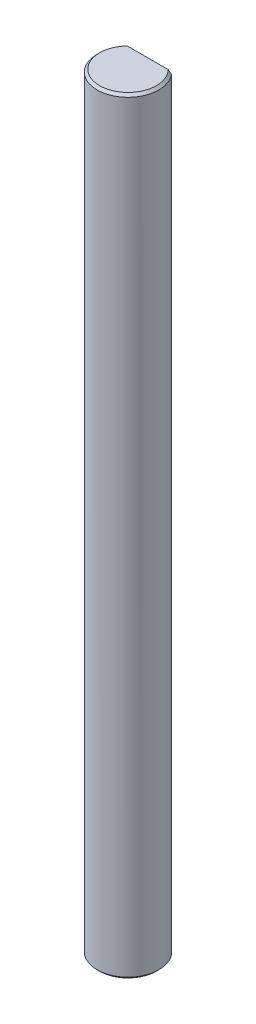
ISO-10303-21;
HEADER;
FILE_DESCRIPTION(('STEP AP214'),'2;1');
FILE_NAME('part.step','',(''),(''),'','','');
FILE_SCHEMA(('AUTOMOTIVE_DESIGN { 1 0 10303 214 1 1 1 1 }'));
ENDSEC;
DATA;
#1=APPLICATION_CONTEXT('core data for automotive mechanical design processes');
#2=APPLICATION_PROTOCOL_DEFINITION('international standard','automotive_design',2000,#1);
#3=PRODUCT_CONTEXT('',#1,'mechanical');
#4=PRODUCT('Part','Part','',(#3));
#5=PRODUCT_RELATED_PRODUCT_CATEGORY('part','',(#4));
#6=PRODUCT_DEFINITION_FORMATION('','',#4);
#7=PRODUCT_DEFINITION_CONTEXT('part definition',#1,'design');
#8=PRODUCT_DEFINITION('design','',#6,#7);
#9=PRODUCT_DEFINITION_SHAPE('','',#8);
#10=(LENGTH_UNIT() NAMED_UNIT(*) SI_UNIT(.MILLI.,.METRE.));
#11=(NAMED_UNIT(*) PLANE_ANGLE_UNIT() SI_UNIT($,.RADIAN.));
#12=(NAMED_UNIT(*) SI_UNIT($,.STERADIAN.) SOLID_ANGLE_UNIT());
#13=UNCERTAINTY_MEASURE_WITH_UNIT(LENGTH_MEASURE(1.E-05),#10,'distance_accuracy_value','');
#14=(GEOMETRIC_REPRESENTATION_CONTEXT(3) GLOBAL_UNCERTAINTY_ASSIGNED_CONTEXT((#13)) GLOBAL_UNIT_ASSIGNED_CONTEXT((#10,
#11,#12)) REPRESENTATION_CONTEXT('',''));
#15=CARTESIAN_POINT('',(0.,0.,0.));
#16=DIRECTION('',(0.,0.,1.));
#17=DIRECTION('',(1.,0.,0.));
#18=AXIS2_PLACEMENT_3D('',#15,#16,#17);
#19=CARTESIAN_POINT('',(0.,89.0710678118653,0.));
#20=DIRECTION('',(0.,-1.,0.));
#21=DIRECTION('',(0.,0.,-1.));
#22=AXIS2_PLACEMENT_3D('',#19,#20,#21);
#23=CYLINDRICAL_SURFACE('',#22,2.5);
#24=CARTESIAN_POINT('',(0.,0.200000000000075,0.));
#25=DIRECTION('',(0.,1.,0.));
#26=DIRECTION('',(0.,0.,1.));
#27=AXIS2_PLACEMENT_3D('',#24,#25,#26);
#28=CIRCLE('',#27,2.5);
#29=CARTESIAN_POINT('',(0.,0.200000000000075,2.5));
#30=VERTEX_POINT('',#29);
#31=EDGE_CURVE('E98',#30,#30,#28,.T.);
#32=ORIENTED_EDGE('',*,*,#31,.T.);
#33=EDGE_LOOP('',(#32));
#34=FACE_BOUND('',#33,.T.);
#35=DIRECTION('',(0.,1.,0.));
#36=VECTOR('',#35,1.);
#37=CARTESIAN_POINT('',(1.92093727122986,44.4999999999998,-1.59999999999999));
#38=LINE('',#37,#36);
#39=CARTESIAN_POINT('',(1.92093727122986,44.4999999999998,-1.59999999999999));
#40=VERTEX_POINT('',#39);
#41=CARTESIAN_POINT('',(1.92093727122986,61.7999999999999,-1.59999999999999));
#42=VERTEX_POINT('',#41);
#43=EDGE_CURVE('E90',#40,#42,#38,.T.);
#44=ORIENTED_EDGE('',*,*,#43,.T.);
#45=CARTESIAN_POINT('',(0.,61.7999999999999,0.));
#46=DIRECTION('',(0.,1.,0.));
#47=DIRECTION('',(0.,0.,1.));
#48=AXIS2_PLACEMENT_3D('',#45,#46,#47);
#49=CIRCLE('',#48,2.5);
#50=CARTESIAN_POINT('',(-1.92093727122987,61.7999999999999,-1.59999999999999));
#51=VERTEX_POINT('',#50);
#52=EDGE_CURVE('E92',#42,#51,#49,.F.);
#53=ORIENTED_EDGE('',*,*,#52,.T.);
#54=DIRECTION('',(0.,1.,0.));
#55=VECTOR('',#54,1.);
#56=CARTESIAN_POINT('',(-1.92093727122987,44.4999999999998,-1.59999999999999));
#57=LINE('',#56,#55);
#58=CARTESIAN_POINT('',(-1.92093727122987,44.4999999999998,-1.59999999999999));
#59=VERTEX_POINT('',#58);
#60=EDGE_CURVE('E89',#59,#51,#57,.T.);
#61=ORIENTED_EDGE('',*,*,#60,.F.);
#62=CARTESIAN_POINT('',(0.,44.4999999999998,0.));
#63=DIRECTION('',(0.,1.,0.));
#64=DIRECTION('',(0.,0.,1.));
#65=AXIS2_PLACEMENT_3D('',#62,#63,#64);
#66=CIRCLE('',#65,2.50000000000001);
#67=EDGE_CURVE('E79',#40,#59,#66,.T.);
#68=ORIENTED_EDGE('',*,*,#67,.F.);
#69=EDGE_LOOP('',(#44,#53,#61,#68));
#70=FACE_BOUND('',#69,.T.);
#71=ADVANCED_FACE('F37',(#34,#70),#23,.T.);
#72=CARTESIAN_POINT('',(0.,0.,0.));
#73=DIRECTION('',(0.,1.,0.));
#74=DIRECTION('',(0.,0.,1.));
#75=AXIS2_PLACEMENT_3D('',#72,#73,#74);
#76=PLANE('',#75);
#77=CARTESIAN_POINT('',(0.,0.,0.));
#78=DIRECTION('',(0.,1.,0.));
#79=DIRECTION('',(0.,0.,1.));
#80=AXIS2_PLACEMENT_3D('',#77,#78,#79);
#81=CIRCLE('',#80,2.29999999999993);
#82=CARTESIAN_POINT('',(0.,0.,2.29999999999993));
#83=VERTEX_POINT('',#82);
#84=EDGE_CURVE('E101',#83,#83,#81,.F.);
#85=ORIENTED_EDGE('',*,*,#84,.T.);
#86=EDGE_LOOP('',(#85));
#87=FACE_BOUND('',#86,.T.);
#88=ADVANCED_FACE('F114',(#87),#76,.F.);
#89=CARTESIAN_POINT('',(2.60645239363269E-11,61.9999999999998,-4.94823051281339E-12));
#90=DIRECTION('',(0.,1.,0.));
#91=DIRECTION('',(0.418379664072418,0.,-0.908272237102209));
#92=AXIS2_PLACEMENT_3D('',#89,#90,#91);
#93=PLANE('',#92);
#94=DIRECTION('',(1.,0.,0.));
#95=VECTOR('',#94,1.);
#96=CARTESIAN_POINT('',(-1.92093727122987,61.9999999999998,-1.59999999999999));
#97=LINE('',#96,#95);
#98=CARTESIAN_POINT('',(-1.65227116418588,61.9999999999998,-1.59999999999999));
#99=VERTEX_POINT('',#98);
#100=CARTESIAN_POINT('',(1.65227116418588,61.9999999999998,-1.59999999999999));
#101=VERTEX_POINT('',#100);
#102=EDGE_CURVE('E86',#99,#101,#97,.T.);
#103=ORIENTED_EDGE('',*,*,#102,.F.);
#104=CARTESIAN_POINT('',(0.,61.9999999999998,0.));
#105=DIRECTION('',(0.,1.,0.));
#106=DIRECTION('',(0.,0.,1.));
#107=AXIS2_PLACEMENT_3D('',#104,#105,#106);
#108=CIRCLE('',#107,2.30000000000003);
#109=EDGE_CURVE('E104',#99,#101,#108,.T.);
#110=ORIENTED_EDGE('',*,*,#109,.T.);
#111=EDGE_LOOP('',(#103,#110));
#112=FACE_BOUND('',#111,.T.);
#113=ADVANCED_FACE('F113',(#112),#93,.T.);
#114=CARTESIAN_POINT('',(-1.92093727122987,44.4999999999998,-1.59999999999999));
#115=DIRECTION('',(0.,0.,1.));
#116=DIRECTION('',(1.,0.,0.));
#117=AXIS2_PLACEMENT_3D('',#114,#115,#116);
#118=PLANE('',#117);
#119=ORIENTED_EDGE('',*,*,#102,.T.);
#120=CARTESIAN_POINT('',(1.65227116418588,61.9999999999998,-1.59999999999999));
#121=CARTESIAN_POINT('',(1.67494120459737,61.9837138916555,-1.59999999999999));
#122=CARTESIAN_POINT('',(1.69753464934541,61.9673214765886,-1.59999999999999));
#123=CARTESIAN_POINT('',(1.74257677922729,61.9343419411129,-1.59999999999999));
#124=CARTESIAN_POINT('',(1.76502547360884,61.9177548333373,-1.59999999999999));
#125=CARTESIAN_POINT('',(1.80978927954135,61.8844018470719,-1.59999999999999));
#126=CARTESIAN_POINT('',(1.83210439215515,61.8676359700074,-1.59999999999999));
#127=CARTESIAN_POINT('',(1.87661141400587,61.833938473705,-1.59999999999999));
#128=CARTESIAN_POINT('',(1.8988033152006,61.8170068438429,-1.59999999999999));
#129=CARTESIAN_POINT('',(1.92093727122987,61.7999999999999,-1.59999999999999));
#130=B_SPLINE_CURVE_WITH_KNOTS('',3,(#120,#121,#122,#123,#124,#125,#126,#127,#128,#129),
.UNSPECIFIED.,.F.,.F.,(4,2,2,2,4),(0.,0.0837401751227888,0.167474946218962,0.251209050189322,
0.334948556822204),.UNSPECIFIED.);
#131=EDGE_CURVE('E11',#101,#42,#130,.T.);
#132=ORIENTED_EDGE('',*,*,#131,.T.);
#133=ORIENTED_EDGE('',*,*,#43,.F.);
#134=DIRECTION('',(1.,0.,0.));
#135=VECTOR('',#134,1.);
#136=CARTESIAN_POINT('',(-1.92093727122987,44.4999999999998,-1.59999999999999));
#137=LINE('',#136,#135);
#138=EDGE_CURVE('E82',#59,#40,#137,.T.);
#139=ORIENTED_EDGE('',*,*,#138,.F.);
#140=ORIENTED_EDGE('',*,*,#60,.T.);
#141=CARTESIAN_POINT('',(-1.92093727122987,61.7999999999999,-1.59999999999999));
#142=CARTESIAN_POINT('',(-1.8988033152006,61.8170068438429,-1.59999999999999));
#143=CARTESIAN_POINT('',(-1.87661141400587,61.833938473705,-1.59999999999999));
#144=CARTESIAN_POINT('',(-1.83210439215515,61.8676359700074,-1.59999999999999));
#145=CARTESIAN_POINT('',(-1.80978927954135,61.8844018470719,-1.59999999999999));
#146=CARTESIAN_POINT('',(-1.76502547360884,61.9177548333373,-1.59999999999999));
#147=CARTESIAN_POINT('',(-1.74257677922728,61.9343419411129,-1.59999999999999));
#148=CARTESIAN_POINT('',(-1.69753464934541,61.9673214765886,-1.59999999999999));
#149=CARTESIAN_POINT('',(-1.67494120459738,61.9837138916555,-1.59999999999999));
#150=CARTESIAN_POINT('',(-1.6522711641859,61.9999999999998,-1.59999999999999));
#151=B_SPLINE_CURVE_WITH_KNOTS('',3,(#141,#142,#143,#144,#145,#146,#147,#148,#149,#150),
.UNSPECIFIED.,.F.,.F.,(4,2,2,2,4),(0.,0.0837395066328795,0.167473610603249,0.251208381699424,
0.334948556822213),.UNSPECIFIED.);
#152=EDGE_CURVE('E52',#51,#99,#151,.T.);
#153=ORIENTED_EDGE('',*,*,#152,.T.);
#154=EDGE_LOOP('',(#119,#132,#133,#139,#140,#153));
#155=FACE_BOUND('',#154,.T.);
#156=ADVANCED_FACE('F88',(#155),#118,.F.);
#157=CARTESIAN_POINT('',(0.,44.4999999999998,0.));
#158=DIRECTION('',(0.,1.,0.));
#159=DIRECTION('',(0.,0.,1.));
#160=AXIS2_PLACEMENT_3D('',#157,#158,#159);
#161=PLANE('',#160);
#162=ORIENTED_EDGE('',*,*,#67,.T.);
#163=ORIENTED_EDGE('',*,*,#138,.T.);
#164=EDGE_LOOP('',(#162,#163));
#165=FACE_BOUND('',#164,.T.);
#166=ADVANCED_FACE('F81',(#165),#161,.T.);
#167=CARTESIAN_POINT('',(0.,0.200000000000075,0.));
#168=DIRECTION('',(0.,1.,0.));
#169=DIRECTION('',(0.,0.,1.));
#170=AXIS2_PLACEMENT_3D('',#167,#168,#169);
#171=CONICAL_SURFACE('',#170,2.5,0.785398163397444);
#172=ORIENTED_EDGE('',*,*,#84,.F.);
#173=EDGE_LOOP('',(#172));
#174=FACE_BOUND('',#173,.T.);
#175=ORIENTED_EDGE('',*,*,#31,.F.);
#176=EDGE_LOOP('',(#175));
#177=FACE_BOUND('',#176,.T.);
#178=ADVANCED_FACE('F125',(#174,#177),#171,.T.);
#179=CARTESIAN_POINT('',(0.,61.9999999999998,0.));
#180=DIRECTION('',(0.,-1.,0.));
#181=DIRECTION('',(0.,0.,-1.));
#182=AXIS2_PLACEMENT_3D('',#179,#180,#181);
#183=CONICAL_SURFACE('',#182,2.30000000000003,0.785398163397479);
#184=ORIENTED_EDGE('',*,*,#152,.F.);
#185=ORIENTED_EDGE('',*,*,#52,.F.);
#186=ORIENTED_EDGE('',*,*,#131,.F.);
#187=ORIENTED_EDGE('',*,*,#109,.F.);
#188=EDGE_LOOP('',(#184,#185,#186,#187));
#189=FACE_BOUND('',#188,.T.);
#190=ADVANCED_FACE('F40',(#189),#183,.T.);
#191=CLOSED_SHELL('',(#71,#88,#113,#156,#166,#178,#190));
#192=MANIFOLD_SOLID_BREP('B2',#191);
#193=ADVANCED_BREP_SHAPE_REPRESENTATION('',(#18,#192),#14);
#194=SHAPE_DEFINITION_REPRESENTATION(#9,#193);
ENDSEC;
END-ISO-10303-21;
